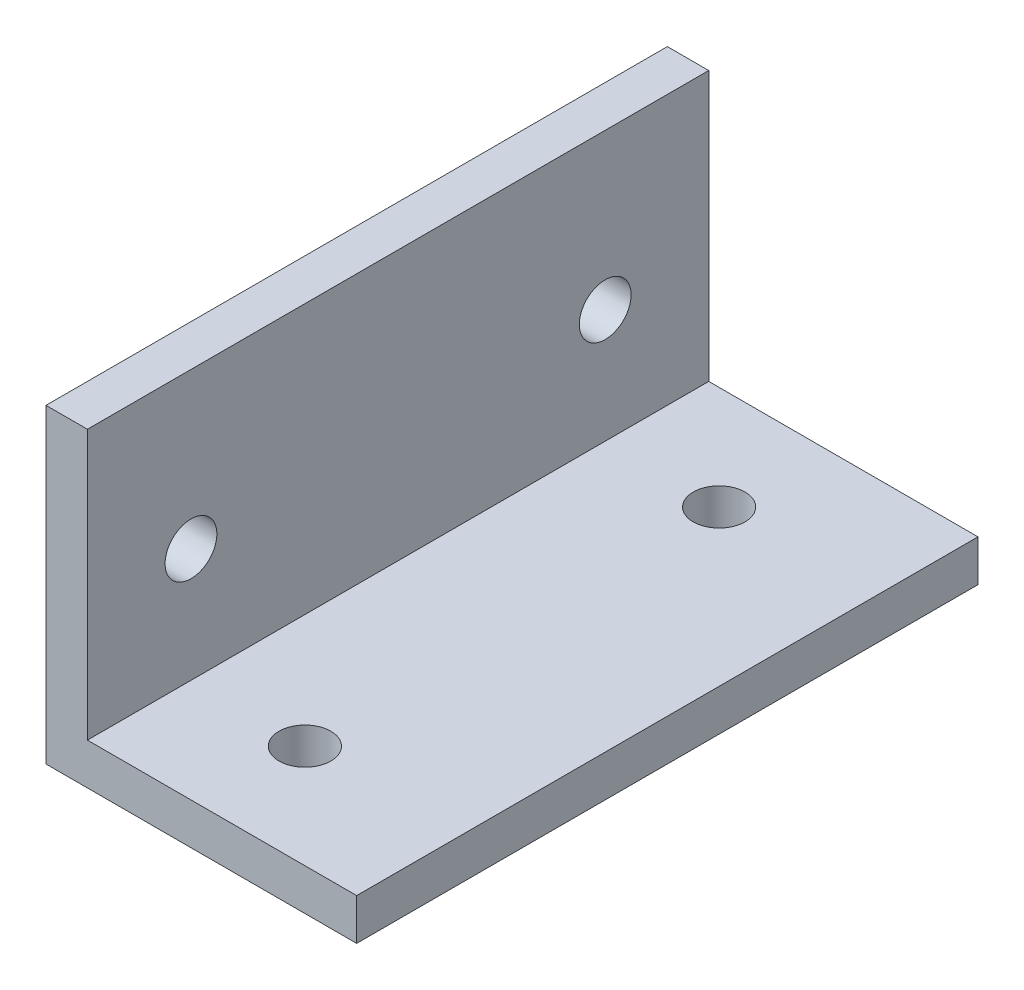
ISO-10303-21;
HEADER;
FILE_DESCRIPTION(('STEP AP214'),'2;1');
FILE_NAME('part.step','',(''),(''),'','','');
FILE_SCHEMA(('AUTOMOTIVE_DESIGN { 1 0 10303 214 1 1 1 1 }'));
ENDSEC;
DATA;
#1=APPLICATION_CONTEXT('core data for automotive mechanical design processes');
#2=APPLICATION_PROTOCOL_DEFINITION('international standard','automotive_design',2000,#1);
#3=PRODUCT_CONTEXT('',#1,'mechanical');
#4=PRODUCT('Part','Part','',(#3));
#5=PRODUCT_RELATED_PRODUCT_CATEGORY('part','',(#4));
#6=PRODUCT_DEFINITION_FORMATION('','',#4);
#7=PRODUCT_DEFINITION_CONTEXT('part definition',#1,'design');
#8=PRODUCT_DEFINITION('design','',#6,#7);
#9=PRODUCT_DEFINITION_SHAPE('','',#8);
#10=(LENGTH_UNIT() NAMED_UNIT(*) SI_UNIT(.MILLI.,.METRE.));
#11=(NAMED_UNIT(*) PLANE_ANGLE_UNIT() SI_UNIT($,.RADIAN.));
#12=(NAMED_UNIT(*) SI_UNIT($,.STERADIAN.) SOLID_ANGLE_UNIT());
#13=UNCERTAINTY_MEASURE_WITH_UNIT(LENGTH_MEASURE(1.E-05),#10,'distance_accuracy_value','');
#14=(GEOMETRIC_REPRESENTATION_CONTEXT(3) GLOBAL_UNCERTAINTY_ASSIGNED_CONTEXT((#13)) GLOBAL_UNIT_ASSIGNED_CONTEXT((#10,
#11,#12)) REPRESENTATION_CONTEXT('',''));
#15=CARTESIAN_POINT('',(0.,0.,0.));
#16=DIRECTION('',(0.,0.,1.));
#17=DIRECTION('',(1.,0.,0.));
#18=AXIS2_PLACEMENT_3D('',#15,#16,#17);
#19=CARTESIAN_POINT('',(0.,0.,30.));
#20=DIRECTION('',(1.,0.,0.));
#21=DIRECTION('',(0.,0.,-1.));
#22=AXIS2_PLACEMENT_3D('',#19,#20,#21);
#23=PLANE('',#22);
#24=CARTESIAN_POINT('',(0.,7.5,25.));
#25=DIRECTION('',(-1.,0.,0.));
#26=DIRECTION('',(0.,0.,1.));
#27=AXIS2_PLACEMENT_3D('',#24,#25,#26);
#28=CIRCLE('',#27,1.24999999999999);
#29=CARTESIAN_POINT('',(0.,7.5,26.25));
#30=VERTEX_POINT('',#29);
#31=EDGE_CURVE('E158',#30,#30,#28,.T.);
#32=ORIENTED_EDGE('',*,*,#31,.F.);
#33=EDGE_LOOP('',(#32));
#34=FACE_BOUND('',#33,.T.);
#35=DIRECTION('',(0.,-1.,0.));
#36=VECTOR('',#35,1.);
#37=CARTESIAN_POINT('',(0.,0.,0.));
#38=LINE('',#37,#36);
#39=CARTESIAN_POINT('',(0.,15.,0.));
#40=VERTEX_POINT('',#39);
#41=CARTESIAN_POINT('',(0.,0.,0.));
#42=VERTEX_POINT('',#41);
#43=EDGE_CURVE('E82',#40,#42,#38,.T.);
#44=ORIENTED_EDGE('',*,*,#43,.T.);
#45=DIRECTION('',(0.,0.,-1.));
#46=VECTOR('',#45,1.);
#47=CARTESIAN_POINT('',(0.,0.,30.));
#48=LINE('',#47,#46);
#49=CARTESIAN_POINT('',(0.,0.,30.));
#50=VERTEX_POINT('',#49);
#51=EDGE_CURVE('E117',#50,#42,#48,.T.);
#52=ORIENTED_EDGE('',*,*,#51,.F.);
#53=DIRECTION('',(0.,-1.,0.));
#54=VECTOR('',#53,1.);
#55=CARTESIAN_POINT('',(0.,0.,30.));
#56=LINE('',#55,#54);
#57=CARTESIAN_POINT('',(0.,15.,30.));
#58=VERTEX_POINT('',#57);
#59=EDGE_CURVE('E53',#58,#50,#56,.T.);
#60=ORIENTED_EDGE('',*,*,#59,.F.);
#61=DIRECTION('',(0.,0.,-1.));
#62=VECTOR('',#61,1.);
#63=CARTESIAN_POINT('',(0.,15.,30.));
#64=LINE('',#63,#62);
#65=EDGE_CURVE('E113',#58,#40,#64,.T.);
#66=ORIENTED_EDGE('',*,*,#65,.T.);
#67=EDGE_LOOP('',(#44,#52,#60,#66));
#68=FACE_BOUND('',#67,.T.);
#69=CARTESIAN_POINT('',(0.,7.5,5.));
#70=DIRECTION('',(-1.,0.,0.));
#71=DIRECTION('',(0.,0.,1.));
#72=AXIS2_PLACEMENT_3D('',#69,#70,#71);
#73=CIRCLE('',#72,1.24999999999999);
#74=CARTESIAN_POINT('',(0.,7.5,6.24999999999999));
#75=VERTEX_POINT('',#74);
#76=EDGE_CURVE('E152',#75,#75,#73,.T.);
#77=ORIENTED_EDGE('',*,*,#76,.F.);
#78=EDGE_LOOP('',(#77));
#79=FACE_BOUND('',#78,.T.);
#80=ADVANCED_FACE('F35',(#34,#68,#79),#23,.F.);
#81=CARTESIAN_POINT('',(15.,0.,30.));
#82=DIRECTION('',(0.,1.,0.));
#83=DIRECTION('',(0.,0.,1.));
#84=AXIS2_PLACEMENT_3D('',#81,#82,#83);
#85=PLANE('',#84);
#86=CARTESIAN_POINT('',(7.49999999999998,0.,5.));
#87=DIRECTION('',(0.,-1.,0.));
#88=DIRECTION('',(0.,0.,-1.));
#89=AXIS2_PLACEMENT_3D('',#86,#87,#88);
#90=CIRCLE('',#89,1.24999999999999);
#91=CARTESIAN_POINT('',(7.49999999999998,0.,3.75000000000001));
#92=VERTEX_POINT('',#91);
#93=EDGE_CURVE('E173',#92,#92,#90,.T.);
#94=ORIENTED_EDGE('',*,*,#93,.F.);
#95=EDGE_LOOP('',(#94));
#96=FACE_BOUND('',#95,.T.);
#97=CARTESIAN_POINT('',(7.49999999999998,0.,25.));
#98=DIRECTION('',(0.,-1.,0.));
#99=DIRECTION('',(0.,0.,-1.));
#100=AXIS2_PLACEMENT_3D('',#97,#98,#99);
#101=CIRCLE('',#100,1.24999999999999);
#102=CARTESIAN_POINT('',(7.49999999999998,0.,23.75));
#103=VERTEX_POINT('',#102);
#104=EDGE_CURVE('E167',#103,#103,#101,.T.);
#105=ORIENTED_EDGE('',*,*,#104,.F.);
#106=EDGE_LOOP('',(#105));
#107=FACE_BOUND('',#106,.T.);
#108=DIRECTION('',(1.,0.,0.));
#109=VECTOR('',#108,1.);
#110=CARTESIAN_POINT('',(15.,0.,0.));
#111=LINE('',#110,#109);
#112=CARTESIAN_POINT('',(15.,0.,0.));
#113=VERTEX_POINT('',#112);
#114=EDGE_CURVE('E121',#42,#113,#111,.T.);
#115=ORIENTED_EDGE('',*,*,#114,.T.);
#116=DIRECTION('',(0.,0.,-1.));
#117=VECTOR('',#116,1.);
#118=CARTESIAN_POINT('',(15.,0.,30.));
#119=LINE('',#118,#117);
#120=CARTESIAN_POINT('',(15.,0.,30.));
#121=VERTEX_POINT('',#120);
#122=EDGE_CURVE('E11',#121,#113,#119,.T.);
#123=ORIENTED_EDGE('',*,*,#122,.F.);
#124=DIRECTION('',(1.,0.,0.));
#125=VECTOR('',#124,1.);
#126=CARTESIAN_POINT('',(15.,0.,30.));
#127=LINE('',#126,#125);
#128=EDGE_CURVE('E132',#50,#121,#127,.T.);
#129=ORIENTED_EDGE('',*,*,#128,.F.);
#130=ORIENTED_EDGE('',*,*,#51,.T.);
#131=EDGE_LOOP('',(#115,#123,#129,#130));
#132=FACE_BOUND('',#131,.T.);
#133=ADVANCED_FACE('F37',(#96,#107,#132),#85,.F.);
#134=CARTESIAN_POINT('',(15.,2.,30.));
#135=DIRECTION('',(-1.,0.,0.));
#136=DIRECTION('',(0.,-1.,0.));
#137=AXIS2_PLACEMENT_3D('',#134,#135,#136);
#138=PLANE('',#137);
#139=DIRECTION('',(0.,1.,0.));
#140=VECTOR('',#139,1.);
#141=CARTESIAN_POINT('',(15.,2.,0.));
#142=LINE('',#141,#140);
#143=CARTESIAN_POINT('',(15.,2.,0.));
#144=VERTEX_POINT('',#143);
#145=EDGE_CURVE('E124',#113,#144,#142,.T.);
#146=ORIENTED_EDGE('',*,*,#145,.T.);
#147=DIRECTION('',(0.,0.,-1.));
#148=VECTOR('',#147,1.);
#149=CARTESIAN_POINT('',(15.,2.,30.));
#150=LINE('',#149,#148);
#151=CARTESIAN_POINT('',(15.,2.,30.));
#152=VERTEX_POINT('',#151);
#153=EDGE_CURVE('E45',#152,#144,#150,.T.);
#154=ORIENTED_EDGE('',*,*,#153,.F.);
#155=DIRECTION('',(0.,1.,0.));
#156=VECTOR('',#155,1.);
#157=CARTESIAN_POINT('',(15.,2.,30.));
#158=LINE('',#157,#156);
#159=EDGE_CURVE('E90',#121,#152,#158,.T.);
#160=ORIENTED_EDGE('',*,*,#159,.F.);
#161=ORIENTED_EDGE('',*,*,#122,.T.);
#162=EDGE_LOOP('',(#146,#154,#160,#161));
#163=FACE_BOUND('',#162,.T.);
#164=ADVANCED_FACE('F182',(#163),#138,.F.);
#165=CARTESIAN_POINT('',(2.,2.,30.));
#166=DIRECTION('',(0.,-1.,0.));
#167=DIRECTION('',(0.,0.,-1.));
#168=AXIS2_PLACEMENT_3D('',#165,#166,#167);
#169=PLANE('',#168);
#170=CARTESIAN_POINT('',(7.49999999999998,2.,5.));
#171=DIRECTION('',(0.,-1.,0.));
#172=DIRECTION('',(0.,0.,-1.));
#173=AXIS2_PLACEMENT_3D('',#170,#171,#172);
#174=CIRCLE('',#173,1.24999999999999);
#175=CARTESIAN_POINT('',(7.49999999999998,2.,3.75000000000001));
#176=VERTEX_POINT('',#175);
#177=EDGE_CURVE('E170',#176,#176,#174,.T.);
#178=ORIENTED_EDGE('',*,*,#177,.T.);
#179=EDGE_LOOP('',(#178));
#180=FACE_BOUND('',#179,.T.);
#181=CARTESIAN_POINT('',(7.49999999999998,2.,25.));
#182=DIRECTION('',(0.,-1.,0.));
#183=DIRECTION('',(0.,0.,-1.));
#184=AXIS2_PLACEMENT_3D('',#181,#182,#183);
#185=CIRCLE('',#184,1.24999999999999);
#186=CARTESIAN_POINT('',(7.49999999999998,2.,23.75));
#187=VERTEX_POINT('',#186);
#188=EDGE_CURVE('E164',#187,#187,#185,.T.);
#189=ORIENTED_EDGE('',*,*,#188,.T.);
#190=EDGE_LOOP('',(#189));
#191=FACE_BOUND('',#190,.T.);
#192=DIRECTION('',(-1.,0.,0.));
#193=VECTOR('',#192,1.);
#194=CARTESIAN_POINT('',(2.,2.,0.));
#195=LINE('',#194,#193);
#196=CARTESIAN_POINT('',(2.,2.,0.));
#197=VERTEX_POINT('',#196);
#198=EDGE_CURVE('E127',#144,#197,#195,.T.);
#199=ORIENTED_EDGE('',*,*,#198,.T.);
#200=DIRECTION('',(0.,0.,-1.));
#201=VECTOR('',#200,1.);
#202=CARTESIAN_POINT('',(2.,2.,30.));
#203=LINE('',#202,#201);
#204=CARTESIAN_POINT('',(2.,2.,30.));
#205=VERTEX_POINT('',#204);
#206=EDGE_CURVE('E112',#205,#197,#203,.T.);
#207=ORIENTED_EDGE('',*,*,#206,.F.);
#208=DIRECTION('',(-1.,0.,0.));
#209=VECTOR('',#208,1.);
#210=CARTESIAN_POINT('',(2.,2.,30.));
#211=LINE('',#210,#209);
#212=EDGE_CURVE('E103',#152,#205,#211,.T.);
#213=ORIENTED_EDGE('',*,*,#212,.F.);
#214=ORIENTED_EDGE('',*,*,#153,.T.);
#215=EDGE_LOOP('',(#199,#207,#213,#214));
#216=FACE_BOUND('',#215,.T.);
#217=ADVANCED_FACE('F139',(#180,#191,#216),#169,.F.);
#218=CARTESIAN_POINT('',(2.,15.,30.));
#219=DIRECTION('',(-1.,0.,0.));
#220=DIRECTION('',(0.,-1.,0.));
#221=AXIS2_PLACEMENT_3D('',#218,#219,#220);
#222=PLANE('',#221);
#223=CARTESIAN_POINT('',(2.,7.5,25.));
#224=DIRECTION('',(-1.,0.,0.));
#225=DIRECTION('',(0.,-1.,0.));
#226=AXIS2_PLACEMENT_3D('',#223,#224,#225);
#227=CIRCLE('',#226,1.24999999999999);
#228=CARTESIAN_POINT('',(2.,6.25000000000001,25.));
#229=VERTEX_POINT('',#228);
#230=EDGE_CURVE('E39',#229,#229,#227,.T.);
#231=ORIENTED_EDGE('',*,*,#230,.T.);
#232=EDGE_LOOP('',(#231));
#233=FACE_BOUND('',#232,.T.);
#234=CARTESIAN_POINT('',(2.,7.5,5.));
#235=DIRECTION('',(-1.,0.,0.));
#236=DIRECTION('',(0.,-1.,0.));
#237=AXIS2_PLACEMENT_3D('',#234,#235,#236);
#238=CIRCLE('',#237,1.24999999999999);
#239=CARTESIAN_POINT('',(2.,6.25000000000001,5.));
#240=VERTEX_POINT('',#239);
#241=EDGE_CURVE('E125',#240,#240,#238,.T.);
#242=ORIENTED_EDGE('',*,*,#241,.T.);
#243=EDGE_LOOP('',(#242));
#244=FACE_BOUND('',#243,.T.);
#245=DIRECTION('',(0.,1.,0.));
#246=VECTOR('',#245,1.);
#247=CARTESIAN_POINT('',(2.,15.,0.));
#248=LINE('',#247,#246);
#249=CARTESIAN_POINT('',(2.,15.,0.));
#250=VERTEX_POINT('',#249);
#251=EDGE_CURVE('E111',#197,#250,#248,.T.);
#252=ORIENTED_EDGE('',*,*,#251,.T.);
#253=DIRECTION('',(0.,0.,-1.));
#254=VECTOR('',#253,1.);
#255=CARTESIAN_POINT('',(2.,15.,30.));
#256=LINE('',#255,#254);
#257=CARTESIAN_POINT('',(2.,15.,30.));
#258=VERTEX_POINT('',#257);
#259=EDGE_CURVE('E108',#258,#250,#256,.T.);
#260=ORIENTED_EDGE('',*,*,#259,.F.);
#261=DIRECTION('',(0.,1.,0.));
#262=VECTOR('',#261,1.);
#263=CARTESIAN_POINT('',(2.,15.,30.));
#264=LINE('',#263,#262);
#265=EDGE_CURVE('E97',#205,#258,#264,.T.);
#266=ORIENTED_EDGE('',*,*,#265,.F.);
#267=ORIENTED_EDGE('',*,*,#206,.T.);
#268=EDGE_LOOP('',(#252,#260,#266,#267));
#269=FACE_BOUND('',#268,.T.);
#270=ADVANCED_FACE('F109',(#233,#244,#269),#222,.F.);
#271=CARTESIAN_POINT('',(0.,15.,30.));
#272=DIRECTION('',(0.,-1.,0.));
#273=DIRECTION('',(0.,0.,-1.));
#274=AXIS2_PLACEMENT_3D('',#271,#272,#273);
#275=PLANE('',#274);
#276=DIRECTION('',(-1.,0.,0.));
#277=VECTOR('',#276,1.);
#278=CARTESIAN_POINT('',(0.,15.,0.));
#279=LINE('',#278,#277);
#280=EDGE_CURVE('E76',#250,#40,#279,.T.);
#281=ORIENTED_EDGE('',*,*,#280,.T.);
#282=ORIENTED_EDGE('',*,*,#65,.F.);
#283=DIRECTION('',(-1.,0.,0.));
#284=VECTOR('',#283,1.);
#285=CARTESIAN_POINT('',(0.,15.,30.));
#286=LINE('',#285,#284);
#287=EDGE_CURVE('E101',#258,#58,#286,.T.);
#288=ORIENTED_EDGE('',*,*,#287,.F.);
#289=ORIENTED_EDGE('',*,*,#259,.T.);
#290=EDGE_LOOP('',(#281,#282,#288,#289));
#291=FACE_BOUND('',#290,.T.);
#292=ADVANCED_FACE('F115',(#291),#275,.F.);
#293=CARTESIAN_POINT('',(0.,0.,30.));
#294=DIRECTION('',(0.,0.,-1.));
#295=DIRECTION('',(-1.,0.,0.));
#296=AXIS2_PLACEMENT_3D('',#293,#294,#295);
#297=PLANE('',#296);
#298=ORIENTED_EDGE('',*,*,#128,.T.);
#299=ORIENTED_EDGE('',*,*,#159,.T.);
#300=ORIENTED_EDGE('',*,*,#212,.T.);
#301=ORIENTED_EDGE('',*,*,#265,.T.);
#302=ORIENTED_EDGE('',*,*,#287,.T.);
#303=ORIENTED_EDGE('',*,*,#59,.T.);
#304=EDGE_LOOP('',(#298,#299,#300,#301,#302,#303));
#305=FACE_BOUND('',#304,.T.);
#306=ADVANCED_FACE('F99',(#305),#297,.F.);
#307=CARTESIAN_POINT('',(0.,0.,0.));
#308=DIRECTION('',(0.,0.,-1.));
#309=DIRECTION('',(-1.,0.,0.));
#310=AXIS2_PLACEMENT_3D('',#307,#308,#309);
#311=PLANE('',#310);
#312=ORIENTED_EDGE('',*,*,#114,.F.);
#313=ORIENTED_EDGE('',*,*,#43,.F.);
#314=ORIENTED_EDGE('',*,*,#280,.F.);
#315=ORIENTED_EDGE('',*,*,#251,.F.);
#316=ORIENTED_EDGE('',*,*,#198,.F.);
#317=ORIENTED_EDGE('',*,*,#145,.F.);
#318=EDGE_LOOP('',(#312,#313,#314,#315,#316,#317));
#319=FACE_BOUND('',#318,.T.);
#320=ADVANCED_FACE('F142',(#319),#311,.T.);
#321=CARTESIAN_POINT('',(0.,7.5,5.));
#322=DIRECTION('',(-1.,0.,0.));
#323=DIRECTION('',(0.,0.,1.));
#324=AXIS2_PLACEMENT_3D('',#321,#322,#323);
#325=CYLINDRICAL_SURFACE('',#324,1.24999999999999);
#326=ORIENTED_EDGE('',*,*,#76,.T.);
#327=EDGE_LOOP('',(#326));
#328=FACE_BOUND('',#327,.T.);
#329=ORIENTED_EDGE('',*,*,#241,.F.);
#330=EDGE_LOOP('',(#329));
#331=FACE_BOUND('',#330,.T.);
#332=ADVANCED_FACE('F206',(#328,#331),#325,.F.);
#333=CARTESIAN_POINT('',(0.,7.5,25.));
#334=DIRECTION('',(-1.,0.,0.));
#335=DIRECTION('',(0.,0.,1.));
#336=AXIS2_PLACEMENT_3D('',#333,#334,#335);
#337=CYLINDRICAL_SURFACE('',#336,1.24999999999999);
#338=ORIENTED_EDGE('',*,*,#31,.T.);
#339=EDGE_LOOP('',(#338));
#340=FACE_BOUND('',#339,.T.);
#341=ORIENTED_EDGE('',*,*,#230,.F.);
#342=EDGE_LOOP('',(#341));
#343=FACE_BOUND('',#342,.T.);
#344=ADVANCED_FACE('F188',(#340,#343),#337,.F.);
#345=CARTESIAN_POINT('',(7.49999999999998,0.,25.));
#346=DIRECTION('',(0.,-1.,0.));
#347=DIRECTION('',(0.,0.,-1.));
#348=AXIS2_PLACEMENT_3D('',#345,#346,#347);
#349=CYLINDRICAL_SURFACE('',#348,1.24999999999999);
#350=ORIENTED_EDGE('',*,*,#104,.T.);
#351=EDGE_LOOP('',(#350));
#352=FACE_BOUND('',#351,.T.);
#353=ORIENTED_EDGE('',*,*,#188,.F.);
#354=EDGE_LOOP('',(#353));
#355=FACE_BOUND('',#354,.T.);
#356=ADVANCED_FACE('F185',(#352,#355),#349,.F.);
#357=CARTESIAN_POINT('',(7.49999999999998,0.,5.));
#358=DIRECTION('',(0.,-1.,0.));
#359=DIRECTION('',(0.,0.,-1.));
#360=AXIS2_PLACEMENT_3D('',#357,#358,#359);
#361=CYLINDRICAL_SURFACE('',#360,1.24999999999999);
#362=ORIENTED_EDGE('',*,*,#93,.T.);
#363=EDGE_LOOP('',(#362));
#364=FACE_BOUND('',#363,.T.);
#365=ORIENTED_EDGE('',*,*,#177,.F.);
#366=EDGE_LOOP('',(#365));
#367=FACE_BOUND('',#366,.T.);
#368=ADVANCED_FACE('F177',(#364,#367),#361,.F.);
#369=CLOSED_SHELL('',(#80,#133,#164,#217,#270,#292,#306,#320,#332,#344,#356,#368));
#370=MANIFOLD_SOLID_BREP('B2',#369);
#371=ADVANCED_BREP_SHAPE_REPRESENTATION('',(#18,#370),#14);
#372=SHAPE_DEFINITION_REPRESENTATION(#9,#371);
ENDSEC;
END-ISO-10303-21;
